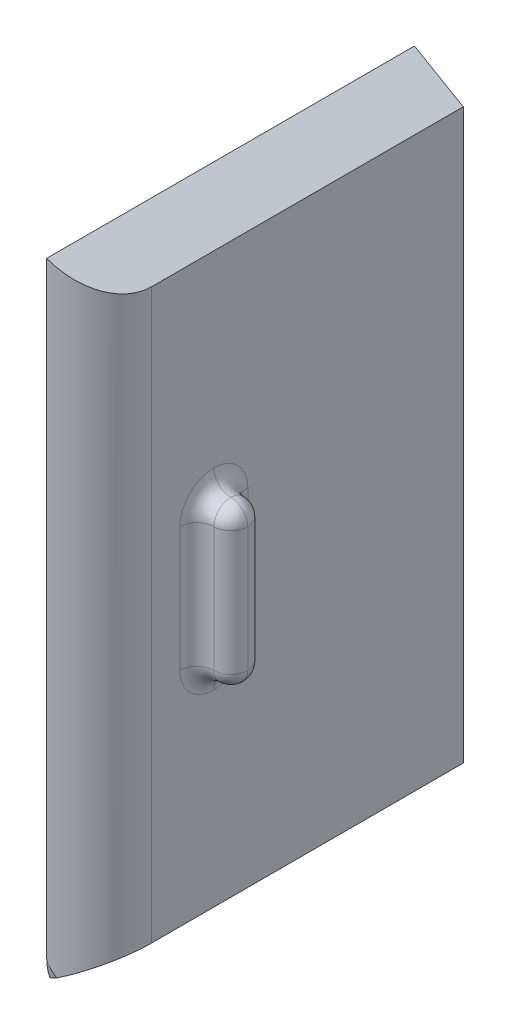
ISO-10303-21;
HEADER;
FILE_DESCRIPTION(('STEP AP214'),'2;1');
FILE_NAME('part.step','',(''),(''),'','','');
FILE_SCHEMA(('AUTOMOTIVE_DESIGN { 1 0 10303 214 1 1 1 1 }'));
ENDSEC;
DATA;
#1=APPLICATION_CONTEXT('core data for automotive mechanical design processes');
#2=APPLICATION_PROTOCOL_DEFINITION('international standard','automotive_design',2000,#1);
#3=PRODUCT_CONTEXT('',#1,'mechanical');
#4=PRODUCT('Part','Part','',(#3));
#5=PRODUCT_RELATED_PRODUCT_CATEGORY('part','',(#4));
#6=PRODUCT_DEFINITION_FORMATION('','',#4);
#7=PRODUCT_DEFINITION_CONTEXT('part definition',#1,'design');
#8=PRODUCT_DEFINITION('design','',#6,#7);
#9=PRODUCT_DEFINITION_SHAPE('','',#8);
#10=(LENGTH_UNIT() NAMED_UNIT(*) SI_UNIT(.MILLI.,.METRE.));
#11=(NAMED_UNIT(*) PLANE_ANGLE_UNIT() SI_UNIT($,.RADIAN.));
#12=(NAMED_UNIT(*) SI_UNIT($,.STERADIAN.) SOLID_ANGLE_UNIT());
#13=UNCERTAINTY_MEASURE_WITH_UNIT(LENGTH_MEASURE(1.E-05),#10,'distance_accuracy_value','');
#14=(GEOMETRIC_REPRESENTATION_CONTEXT(3) GLOBAL_UNCERTAINTY_ASSIGNED_CONTEXT((#13)) GLOBAL_UNIT_ASSIGNED_CONTEXT((#10,
#11,#12)) REPRESENTATION_CONTEXT('',''));
#15=CARTESIAN_POINT('',(0.,0.,0.));
#16=DIRECTION('',(0.,0.,1.));
#17=DIRECTION('',(1.,0.,0.));
#18=AXIS2_PLACEMENT_3D('',#15,#16,#17);
#19=CARTESIAN_POINT('',(7.51840000000001,-33.6681989634393,-87.8829762420417));
#20=DIRECTION('',(0.5,-0.866025403784439,0.));
#21=DIRECTION('',(0.866025403784439,0.5,0.));
#22=AXIS2_PLACEMENT_3D('',#19,#20,#21);
#23=PLANE('',#22);
#24=CARTESIAN_POINT('',(6.0776783428885,-34.5,-5.));
#25=DIRECTION('',(0.5,-0.866025403784439,0.));
#26=DIRECTION('',(-0.866025403784439,-0.5,0.));
#27=AXIS2_PLACEMENT_3D('',#24,#25,#26);
#28=ELLIPSE('',#27,10.,5.);
#29=CARTESIAN_POINT('',(3.19999999999998,-36.1614283659078,-0.284106046044196));
#30=VERTEX_POINT('',#29);
#31=CARTESIAN_POINT('',(3.92879511642385,-35.7406583092564,-0.156368412061765));
#32=VERTEX_POINT('',#31);
#33=EDGE_CURVE('E60',#30,#32,#28,.F.);
#34=ORIENTED_EDGE('',*,*,#33,.F.);
#35=DIRECTION('',(0.,0.,1.));
#36=VECTOR('',#35,1.);
#37=CARTESIAN_POINT('',(3.19999999999999,-36.1614283659078,-87.8829762420417));
#38=LINE('',#37,#36);
#39=CARTESIAN_POINT('',(3.19999999999999,-36.1614283659078,-32.5));
#40=VERTEX_POINT('',#39);
#41=EDGE_CURVE('E179',#40,#30,#38,.T.);
#42=ORIENTED_EDGE('',*,*,#41,.F.);
#43=DIRECTION('',(0.866025403784439,0.5,0.));
#44=VECTOR('',#43,1.);
#45=CARTESIAN_POINT('',(7.51840000000001,-33.6681989634393,-32.5));
#46=LINE('',#45,#44);
#47=CARTESIAN_POINT('',(7.51840000000001,-33.6681989634393,-32.5));
#48=VERTEX_POINT('',#47);
#49=EDGE_CURVE('E219',#40,#48,#46,.T.);
#50=ORIENTED_EDGE('',*,*,#49,.T.);
#51=DIRECTION('',(0.,0.,1.));
#52=VECTOR('',#51,1.);
#53=CARTESIAN_POINT('',(7.51840000000001,-33.6681989634393,-87.8829762420417));
#54=LINE('',#53,#52);
#55=CARTESIAN_POINT('',(7.51840000000001,-33.6681989634393,-4.95332428173242));
#56=VERTEX_POINT('',#55);
#57=EDGE_CURVE('E225',#48,#56,#54,.T.);
#58=ORIENTED_EDGE('',*,*,#57,.T.);
#59=CARTESIAN_POINT('',(2.51840000000001,-36.5549503093875,-4.95332428173242));
#60=DIRECTION('',(0.5,-0.866025403784439,0.));
#61=DIRECTION('',(0.866025403784439,0.5,0.));
#62=AXIS2_PLACEMENT_3D('',#59,#60,#61);
#63=ELLIPSE('',#62,5.77350269189626,5.);
#64=EDGE_CURVE('E204',#56,#32,#63,.T.);
#65=ORIENTED_EDGE('',*,*,#64,.T.);
#66=EDGE_LOOP('',(#34,#42,#50,#58,#65));
#67=FACE_BOUND('',#66,.T.);
#68=ADVANCED_FACE('F43',(#67),#23,.T.);
#69=CARTESIAN_POINT('',(3.19999999999999,-36.1614283659078,-87.8829762420417));
#70=DIRECTION('',(-1.,0.,0.));
#71=DIRECTION('',(0.,-1.,0.));
#72=AXIS2_PLACEMENT_3D('',#69,#70,#71);
#73=PLANE('',#72);
#74=CARTESIAN_POINT('',(3.19999999999998,-34.5,-5.));
#75=DIRECTION('',(1.,0.,0.));
#76=DIRECTION('',(0.,1.,0.));
#77=AXIS2_PLACEMENT_3D('',#74,#75,#76);
#78=CIRCLE('',#77,5.);
#79=CARTESIAN_POINT('',(3.19999999999998,-34.5,0.));
#80=VERTEX_POINT('',#79);
#81=EDGE_CURVE('E246',#80,#30,#78,.T.);
#82=ORIENTED_EDGE('',*,*,#81,.F.);
#83=DIRECTION('',(0.,-1.,0.));
#84=VECTOR('',#83,1.);
#85=CARTESIAN_POINT('',(3.19999999999999,-36.1614283659078,0.));
#86=LINE('',#85,#84);
#87=CARTESIAN_POINT('',(3.19999999999998,19.0529309880371,0.));
#88=VERTEX_POINT('',#87);
#89=EDGE_CURVE('E176',#88,#80,#86,.T.);
#90=ORIENTED_EDGE('',*,*,#89,.F.);
#91=DIRECTION('',(0.,0.,1.));
#92=VECTOR('',#91,1.);
#93=CARTESIAN_POINT('',(3.19999999999998,19.0529309880371,-87.8829762420417));
#94=LINE('',#93,#92);
#95=CARTESIAN_POINT('',(3.19999999999998,19.0529309880371,-32.5));
#96=VERTEX_POINT('',#95);
#97=EDGE_CURVE('E222',#96,#88,#94,.T.);
#98=ORIENTED_EDGE('',*,*,#97,.F.);
#99=DIRECTION('',(0.,-1.,0.));
#100=VECTOR('',#99,1.);
#101=CARTESIAN_POINT('',(3.19999999999999,-36.1614283659078,-32.5));
#102=LINE('',#101,#100);
#103=EDGE_CURVE('E214',#96,#40,#102,.T.);
#104=ORIENTED_EDGE('',*,*,#103,.T.);
#105=ORIENTED_EDGE('',*,*,#41,.T.);
#106=EDGE_LOOP('',(#82,#90,#98,#104,#105));
#107=FACE_BOUND('',#106,.T.);
#108=ADVANCED_FACE('F263',(#107),#73,.T.);
#109=CARTESIAN_POINT('',(7.51840000000001,16.5597015855686,-87.8829762420417));
#110=DIRECTION('',(1.,0.,0.));
#111=DIRECTION('',(0.,1.,0.));
#112=AXIS2_PLACEMENT_3D('',#109,#110,#111);
#113=PLANE('',#112);
#114=DIRECTION('',(0.,0.,1.));
#115=VECTOR('',#114,1.);
#116=CARTESIAN_POINT('',(7.51840000000001,16.5597015855686,-87.8829762420417));
#117=LINE('',#116,#115);
#118=CARTESIAN_POINT('',(7.5184,16.5597015855686,-32.5));
#119=VERTEX_POINT('',#118);
#120=CARTESIAN_POINT('',(7.51840000000001,16.5597015855686,-4.95332428173242));
#121=VERTEX_POINT('',#120);
#122=EDGE_CURVE('E228',#119,#121,#117,.T.);
#123=ORIENTED_EDGE('',*,*,#122,.T.);
#124=DIRECTION('',(0.,-1.,0.));
#125=VECTOR('',#124,1.);
#126=CARTESIAN_POINT('',(7.51840000000001,-33.6681989634393,-4.95332428173242));
#127=LINE('',#126,#125);
#128=EDGE_CURVE('E206',#121,#56,#127,.T.);
#129=ORIENTED_EDGE('',*,*,#128,.T.);
#130=ORIENTED_EDGE('',*,*,#57,.F.);
#131=DIRECTION('',(0.,1.,0.));
#132=VECTOR('',#131,1.);
#133=CARTESIAN_POINT('',(7.51840000000001,16.5597015855686,-32.5));
#134=LINE('',#133,#132);
#135=EDGE_CURVE('E215',#48,#119,#134,.T.);
#136=ORIENTED_EDGE('',*,*,#135,.T.);
#137=EDGE_LOOP('',(#123,#129,#130,#136));
#138=FACE_BOUND('',#137,.T.);
#139=CARTESIAN_POINT('',(7.51840000000001,-3.05424868893539,-10.4533242817324));
#140=DIRECTION('',(1.,0.,0.));
#141=DIRECTION('',(0.,1.,0.));
#142=AXIS2_PLACEMENT_3D('',#139,#140,#141);
#143=CIRCLE('',#142,3.);
#144=CARTESIAN_POINT('',(7.51840000000001,-0.0542486889353898,-10.4533242817324));
#145=VERTEX_POINT('',#144);
#146=CARTESIAN_POINT('',(7.51840000000001,-3.05424868893539,-7.45332428173242));
#147=VERTEX_POINT('',#146);
#148=EDGE_CURVE('E127',#145,#147,#143,.T.);
#149=ORIENTED_EDGE('',*,*,#148,.F.);
#150=CARTESIAN_POINT('',(7.51840000000001,-3.05424868893539,-10.4533242817324));
#151=DIRECTION('',(1.,0.,0.));
#152=DIRECTION('',(0.,1.,0.));
#153=AXIS2_PLACEMENT_3D('',#150,#151,#152);
#154=CIRCLE('',#153,3.);
#155=CARTESIAN_POINT('',(7.51840000000001,-3.05424868893539,-13.4533242817324));
#156=VERTEX_POINT('',#155);
#157=EDGE_CURVE('E192',#156,#145,#154,.T.);
#158=ORIENTED_EDGE('',*,*,#157,.F.);
#159=DIRECTION('',(0.,1.,0.));
#160=VECTOR('',#159,1.);
#161=CARTESIAN_POINT('',(7.51840000000001,16.5597015855685,-13.4533242817324));
#162=LINE('',#161,#160);
#163=CARTESIAN_POINT('',(7.51840000000001,-14.0542486889354,-13.4533242817324));
#164=VERTEX_POINT('',#163);
#165=EDGE_CURVE('E188',#156,#164,#162,.F.);
#166=ORIENTED_EDGE('',*,*,#165,.T.);
#167=CARTESIAN_POINT('',(7.51840000000001,-14.0542486889354,-10.4533242817324));
#168=DIRECTION('',(1.,0.,0.));
#169=DIRECTION('',(0.,1.,0.));
#170=AXIS2_PLACEMENT_3D('',#167,#168,#169);
#171=CIRCLE('',#170,3.);
#172=CARTESIAN_POINT('',(7.51840000000001,-17.0542486889354,-10.4533242817324));
#173=VERTEX_POINT('',#172);
#174=EDGE_CURVE('E185',#173,#164,#171,.T.);
#175=ORIENTED_EDGE('',*,*,#174,.F.);
#176=CARTESIAN_POINT('',(7.51840000000001,-14.0542486889354,-10.4533242817324));
#177=DIRECTION('',(1.,0.,0.));
#178=DIRECTION('',(0.,1.,0.));
#179=AXIS2_PLACEMENT_3D('',#176,#177,#178);
#180=CIRCLE('',#179,3.);
#181=CARTESIAN_POINT('',(7.51840000000001,-14.0542486889354,-7.45332428173242));
#182=VERTEX_POINT('',#181);
#183=EDGE_CURVE('E149',#182,#173,#180,.T.);
#184=ORIENTED_EDGE('',*,*,#183,.F.);
#185=DIRECTION('',(0.,-1.,0.));
#186=VECTOR('',#185,1.);
#187=CARTESIAN_POINT('',(7.51840000000001,16.5597015855685,-7.45332428173243));
#188=LINE('',#187,#186);
#189=EDGE_CURVE('E190',#182,#147,#188,.F.);
#190=ORIENTED_EDGE('',*,*,#189,.T.);
#191=EDGE_LOOP('',(#149,#158,#166,#175,#184,#190));
#192=FACE_BOUND('',#191,.T.);
#193=ADVANCED_FACE('F259',(#138,#192),#113,.T.);
#194=CARTESIAN_POINT('',(3.19999999999998,19.0529309880371,-87.8829762420417));
#195=DIRECTION('',(0.5,0.866025403784439,0.));
#196=DIRECTION('',(-0.866025403784439,0.5,0.));
#197=AXIS2_PLACEMENT_3D('',#194,#195,#196);
#198=PLANE('',#197);
#199=ORIENTED_EDGE('',*,*,#97,.T.);
#200=CARTESIAN_POINT('',(2.5184,19.4464529315167,-4.95332428173242));
#201=DIRECTION('',(0.5,0.866025403784439,0.));
#202=DIRECTION('',(-0.866025403784439,0.5,0.));
#203=AXIS2_PLACEMENT_3D('',#200,#201,#202);
#204=ELLIPSE('',#203,5.77350269189626,5.);
#205=EDGE_CURVE('E211',#88,#121,#204,.T.);
#206=ORIENTED_EDGE('',*,*,#205,.T.);
#207=ORIENTED_EDGE('',*,*,#122,.F.);
#208=DIRECTION('',(-0.866025403784439,0.5,0.));
#209=VECTOR('',#208,1.);
#210=CARTESIAN_POINT('',(3.19999999999998,19.052930988037,-32.5));
#211=LINE('',#210,#209);
#212=EDGE_CURVE('E218',#119,#96,#211,.T.);
#213=ORIENTED_EDGE('',*,*,#212,.T.);
#214=EDGE_LOOP('',(#199,#206,#207,#213));
#215=FACE_BOUND('',#214,.T.);
#216=ADVANCED_FACE('F255',(#215),#198,.T.);
#217=CARTESIAN_POINT('',(0.,0.,-32.5));
#218=DIRECTION('',(0.,0.,-1.));
#219=DIRECTION('',(0.,1.,0.));
#220=AXIS2_PLACEMENT_3D('',#217,#218,#219);
#221=PLANE('',#220);
#222=ORIENTED_EDGE('',*,*,#135,.F.);
#223=ORIENTED_EDGE('',*,*,#49,.F.);
#224=ORIENTED_EDGE('',*,*,#103,.F.);
#225=ORIENTED_EDGE('',*,*,#212,.F.);
#226=EDGE_LOOP('',(#222,#223,#224,#225));
#227=FACE_BOUND('',#226,.T.);
#228=ADVANCED_FACE('F251',(#227),#221,.T.);
#229=CARTESIAN_POINT('',(2.51840000000001,0.,-4.95332428173242));
#230=DIRECTION('',(0.,1.,0.));
#231=DIRECTION('',(-1.,0.,0.));
#232=AXIS2_PLACEMENT_3D('',#229,#230,#231);
#233=CYLINDRICAL_SURFACE('',#232,5.);
#234=CARTESIAN_POINT('',(3.19999999999998,-34.5,0.));
#235=CARTESIAN_POINT('',(3.19974022040583,-34.5521415158443,1.82125224956412E-05));
#236=CARTESIAN_POINT('',(3.20595871298937,-34.6036520293249,-0.000814210793002077));
#237=CARTESIAN_POINT('',(3.22788334683383,-34.7034276396125,-0.00390160884452909));
#238=CARTESIAN_POINT('',(3.24336883089618,-34.7517400555228,-0.00612355133984807));
#239=CARTESIAN_POINT('',(3.28259551977134,-34.8505197935517,-0.0120271832569065));
#240=CARTESIAN_POINT('',(3.30703213008149,-34.9006818810878,-0.0158375067557172));
#241=CARTESIAN_POINT('',(3.36047119049653,-34.9984516908501,-0.0246665844249504));
#242=CARTESIAN_POINT('',(3.38948297883622,-35.0460539157629,-0.0296878214907631));
#243=CARTESIAN_POINT('',(3.48222387122209,-35.1885923653909,-0.0466954439299404));
#244=CARTESIAN_POINT('',(3.55027385256511,-35.2804533434416,-0.0604392371585273));
#245=CARTESIAN_POINT('',(3.67654809528612,-35.4417453328279,-0.0889568113503177));
#246=CARTESIAN_POINT('',(3.73398975323904,-35.5119666315379,-0.102965206134418));
#247=CARTESIAN_POINT('',(3.85048238121999,-35.6505544792488,-0.133659227157761));
#248=CARTESIAN_POINT('',(3.90953428321242,-35.7189199064036,-0.150346432343317));
#249=CARTESIAN_POINT('',(4.02484918057222,-35.8501941935754,-0.185303065534363));
#250=CARTESIAN_POINT('',(4.0810672621642,-35.9131845484073,-0.203417768945925));
#251=CARTESIAN_POINT('',(4.19379234986491,-36.0380653284678,-0.241995677979165));
#252=CARTESIAN_POINT('',(4.25029902733219,-36.0999567502527,-0.262456615567674));
#253=CARTESIAN_POINT('',(4.3068074109432,-36.1614283659078,-0.284106046044198));
#254=B_SPLINE_CURVE_WITH_KNOTS('',3,(#234,#235,#236,#237,#238,#239,#240,#241,#242,#243,#244,
#245,#246,#247,#248,#249,#250,#251,#252,#253),.UNSPECIFIED.,.F.,.F.,(4,2,2,2,2,2,2,2,2,4),(0.,
0.155076239861064,0.306599186717242,0.474010318815843,0.641767679044356,0.986604246178533,
1.26196597208303,1.5374906018801,1.79650549170412,2.05527207756317),.UNSPECIFIED.);
#255=EDGE_CURVE('E238',#80,#32,#254,.T.);
#256=ORIENTED_EDGE('',*,*,#255,.T.);
#257=ORIENTED_EDGE('',*,*,#64,.F.);
#258=ORIENTED_EDGE('',*,*,#128,.F.);
#259=ORIENTED_EDGE('',*,*,#205,.F.);
#260=ORIENTED_EDGE('',*,*,#89,.T.);
#261=EDGE_LOOP('',(#256,#257,#258,#259,#260));
#262=FACE_BOUND('',#261,.T.);
#263=ADVANCED_FACE('F254',(#262),#233,.T.);
#264=CARTESIAN_POINT('',(9.01840000000001,0.,-10.4533242817324));
#265=DIRECTION('',(0.,-1.,0.));
#266=DIRECTION('',(1.,0.,0.));
#267=AXIS2_PLACEMENT_3D('',#264,#265,#266);
#268=CYLINDRICAL_SURFACE('',#267,1.5);
#269=DIRECTION('',(0.,1.,0.));
#270=VECTOR('',#269,1.);
#271=CARTESIAN_POINT('',(10.5184,-1.55424868893539,-10.4533242817324));
#272=LINE('',#271,#270);
#273=CARTESIAN_POINT('',(10.5184,-14.0542486889354,-10.4533242817324));
#274=VERTEX_POINT('',#273);
#275=CARTESIAN_POINT('',(10.5184,-3.05424868893539,-10.4533242817324));
#276=VERTEX_POINT('',#275);
#277=EDGE_CURVE('E123',#274,#276,#272,.T.);
#278=ORIENTED_EDGE('',*,*,#277,.F.);
#279=CARTESIAN_POINT('',(9.01840000000001,-14.0542486889354,-10.4533242817324));
#280=DIRECTION('',(0.,-1.,0.));
#281=DIRECTION('',(1.,0.,0.));
#282=AXIS2_PLACEMENT_3D('',#279,#280,#281);
#283=CIRCLE('',#282,1.5);
#284=CARTESIAN_POINT('',(9.01840000000001,-14.0542486889354,-11.9533242817324));
#285=VERTEX_POINT('',#284);
#286=EDGE_CURVE('E11',#274,#285,#283,.F.);
#287=ORIENTED_EDGE('',*,*,#286,.T.);
#288=DIRECTION('',(0.,1.,0.));
#289=VECTOR('',#288,1.);
#290=CARTESIAN_POINT('',(9.01840000000001,-15.5542486889354,-11.9533242817324));
#291=LINE('',#290,#289);
#292=CARTESIAN_POINT('',(9.01840000000001,-3.05424868893539,-11.9533242817324));
#293=VERTEX_POINT('',#292);
#294=EDGE_CURVE('E150',#293,#285,#291,.F.);
#295=ORIENTED_EDGE('',*,*,#294,.F.);
#296=CARTESIAN_POINT('',(9.01840000000001,-3.05424868893539,-10.4533242817324));
#297=DIRECTION('',(0.,-1.,0.));
#298=DIRECTION('',(1.,0.,0.));
#299=AXIS2_PLACEMENT_3D('',#296,#297,#298);
#300=CIRCLE('',#299,1.5);
#301=EDGE_CURVE('E52',#293,#276,#300,.T.);
#302=ORIENTED_EDGE('',*,*,#301,.T.);
#303=EDGE_LOOP('',(#278,#287,#295,#302));
#304=FACE_BOUND('',#303,.T.);
#305=ADVANCED_FACE('F197',(#304),#268,.T.);
#306=CARTESIAN_POINT('',(9.01840000000001,0.,-10.4533242817324));
#307=DIRECTION('',(0.,1.,0.));
#308=DIRECTION('',(0.,0.,1.));
#309=AXIS2_PLACEMENT_3D('',#306,#307,#308);
#310=CYLINDRICAL_SURFACE('',#309,1.5);
#311=DIRECTION('',(0.,-1.,0.));
#312=VECTOR('',#311,1.);
#313=CARTESIAN_POINT('',(9.01840000000001,-1.55424868893539,-8.95332428173242));
#314=LINE('',#313,#312);
#315=CARTESIAN_POINT('',(9.01840000000001,-14.0542486889354,-8.95332428173242));
#316=VERTEX_POINT('',#315);
#317=CARTESIAN_POINT('',(9.01840000000001,-3.05424868893539,-8.95332428173242));
#318=VERTEX_POINT('',#317);
#319=EDGE_CURVE('E122',#316,#318,#314,.F.);
#320=ORIENTED_EDGE('',*,*,#319,.F.);
#321=CARTESIAN_POINT('',(9.01840000000001,-14.0542486889354,-10.4533242817324));
#322=DIRECTION('',(0.,1.,0.));
#323=DIRECTION('',(0.,0.,1.));
#324=AXIS2_PLACEMENT_3D('',#321,#322,#323);
#325=CIRCLE('',#324,1.5);
#326=EDGE_CURVE('E126',#316,#274,#325,.T.);
#327=ORIENTED_EDGE('',*,*,#326,.T.);
#328=ORIENTED_EDGE('',*,*,#277,.T.);
#329=CARTESIAN_POINT('',(9.01840000000001,-3.05424868893539,-10.4533242817324));
#330=DIRECTION('',(0.,1.,0.));
#331=DIRECTION('',(0.,0.,1.));
#332=AXIS2_PLACEMENT_3D('',#329,#330,#331);
#333=CIRCLE('',#332,1.5);
#334=EDGE_CURVE('E118',#276,#318,#333,.F.);
#335=ORIENTED_EDGE('',*,*,#334,.T.);
#336=EDGE_LOOP('',(#320,#327,#328,#335));
#337=FACE_BOUND('',#336,.T.);
#338=ADVANCED_FACE('F120',(#337),#310,.T.);
#339=CARTESIAN_POINT('',(9.01840000000001,-14.0542486889354,-10.4533242817324));
#340=DIRECTION('',(0.,0.,1.));
#341=DIRECTION('',(1.,0.,0.));
#342=AXIS2_PLACEMENT_3D('',#339,#340,#341);
#343=SPHERICAL_SURFACE('',#342,1.5);
#344=CARTESIAN_POINT('',(9.01840000000001,-14.0542486889354,-10.4533242817324));
#345=DIRECTION('',(-1.,0.,0.));
#346=DIRECTION('',(0.,0.,1.));
#347=AXIS2_PLACEMENT_3D('',#344,#345,#346);
#348=CIRCLE('',#347,1.5);
#349=CARTESIAN_POINT('',(9.01840000000001,-15.5542486889354,-10.4533242817324));
#350=VERTEX_POINT('',#349);
#351=EDGE_CURVE('E170',#285,#350,#348,.T.);
#352=ORIENTED_EDGE('',*,*,#351,.F.);
#353=ORIENTED_EDGE('',*,*,#286,.F.);
#354=CARTESIAN_POINT('',(9.01840000000001,-14.0542486889354,-10.4533242817324));
#355=DIRECTION('',(0.,0.,1.));
#356=DIRECTION('',(1.,0.,0.));
#357=AXIS2_PLACEMENT_3D('',#354,#355,#356);
#358=CIRCLE('',#357,1.5);
#359=EDGE_CURVE('E47',#350,#274,#358,.T.);
#360=ORIENTED_EDGE('',*,*,#359,.F.);
#361=EDGE_LOOP('',(#352,#353,#360));
#362=FACE_BOUND('',#361,.T.);
#363=ADVANCED_FACE('F45',(#362),#343,.T.);
#364=CARTESIAN_POINT('',(9.01840000000001,-14.0542486889354,-10.4533242817324));
#365=DIRECTION('',(0.,0.,1.));
#366=DIRECTION('',(1.,0.,0.));
#367=AXIS2_PLACEMENT_3D('',#364,#365,#366);
#368=SPHERICAL_SURFACE('',#367,1.5);
#369=ORIENTED_EDGE('',*,*,#359,.T.);
#370=ORIENTED_EDGE('',*,*,#326,.F.);
#371=CARTESIAN_POINT('',(9.01840000000001,-14.0542486889354,-10.4533242817324));
#372=DIRECTION('',(-1.,0.,0.));
#373=DIRECTION('',(0.,0.,1.));
#374=AXIS2_PLACEMENT_3D('',#371,#372,#373);
#375=CIRCLE('',#374,1.5);
#376=EDGE_CURVE('E169',#350,#316,#375,.T.);
#377=ORIENTED_EDGE('',*,*,#376,.F.);
#378=EDGE_LOOP('',(#369,#370,#377));
#379=FACE_BOUND('',#378,.T.);
#380=ADVANCED_FACE('F299',(#379),#368,.T.);
#381=CARTESIAN_POINT('',(9.01840000000001,-14.0542486889354,-10.4533242817324));
#382=DIRECTION('',(1.,0.,0.));
#383=DIRECTION('',(0.,1.,0.));
#384=AXIS2_PLACEMENT_3D('',#381,#382,#383);
#385=TOROIDAL_SURFACE('',#384,3.,1.5);
#386=CARTESIAN_POINT('',(9.01840000000001,-17.0542486889354,-10.4533242817324));
#387=DIRECTION('',(0.,0.,1.));
#388=DIRECTION('',(1.,0.,0.));
#389=AXIS2_PLACEMENT_3D('',#386,#387,#388);
#390=CIRCLE('',#389,1.5);
#391=EDGE_CURVE('E166',#350,#173,#390,.T.);
#392=ORIENTED_EDGE('',*,*,#391,.T.);
#393=ORIENTED_EDGE('',*,*,#174,.T.);
#394=CARTESIAN_POINT('',(9.01840000000001,-14.0542486889354,-13.4533242817324));
#395=DIRECTION('',(0.,1.,0.));
#396=DIRECTION('',(0.,0.,1.));
#397=AXIS2_PLACEMENT_3D('',#394,#395,#396);
#398=CIRCLE('',#397,1.5);
#399=EDGE_CURVE('E162',#285,#164,#398,.F.);
#400=ORIENTED_EDGE('',*,*,#399,.F.);
#401=ORIENTED_EDGE('',*,*,#351,.T.);
#402=EDGE_LOOP('',(#392,#393,#400,#401));
#403=FACE_BOUND('',#402,.T.);
#404=ADVANCED_FACE('F199',(#403),#385,.F.);
#405=CARTESIAN_POINT('',(9.01840000000001,-3.05424868893539,-10.4533242817324));
#406=DIRECTION('',(0.,0.,1.));
#407=DIRECTION('',(1.,0.,0.));
#408=AXIS2_PLACEMENT_3D('',#405,#406,#407);
#409=SPHERICAL_SURFACE('',#408,1.5);
#410=CARTESIAN_POINT('',(9.01840000000001,-3.05424868893539,-10.4533242817324));
#411=DIRECTION('',(0.,0.,-1.));
#412=DIRECTION('',(0.,1.,0.));
#413=AXIS2_PLACEMENT_3D('',#410,#411,#412);
#414=CIRCLE('',#413,1.5);
#415=CARTESIAN_POINT('',(9.01840000000001,-1.55424868893539,-10.4533242817324));
#416=VERTEX_POINT('',#415);
#417=EDGE_CURVE('E132',#276,#416,#414,.F.);
#418=ORIENTED_EDGE('',*,*,#417,.F.);
#419=ORIENTED_EDGE('',*,*,#301,.F.);
#420=CARTESIAN_POINT('',(9.01840000000001,-3.05424868893539,-10.4533242817324));
#421=DIRECTION('',(-1.,0.,0.));
#422=DIRECTION('',(0.,0.,1.));
#423=AXIS2_PLACEMENT_3D('',#420,#421,#422);
#424=CIRCLE('',#423,1.5);
#425=EDGE_CURVE('E138',#416,#293,#424,.T.);
#426=ORIENTED_EDGE('',*,*,#425,.F.);
#427=EDGE_LOOP('',(#418,#419,#426));
#428=FACE_BOUND('',#427,.T.);
#429=ADVANCED_FACE('F294',(#428),#409,.T.);
#430=CARTESIAN_POINT('',(9.01840000000001,-3.05424868893539,-10.4533242817324));
#431=DIRECTION('',(0.,0.,1.));
#432=DIRECTION('',(1.,0.,0.));
#433=AXIS2_PLACEMENT_3D('',#430,#431,#432);
#434=SPHERICAL_SURFACE('',#433,1.5);
#435=ORIENTED_EDGE('',*,*,#334,.F.);
#436=ORIENTED_EDGE('',*,*,#417,.T.);
#437=CARTESIAN_POINT('',(9.01840000000001,-3.05424868893539,-10.4533242817324));
#438=DIRECTION('',(-1.,0.,0.));
#439=DIRECTION('',(0.,0.,1.));
#440=AXIS2_PLACEMENT_3D('',#437,#438,#439);
#441=CIRCLE('',#440,1.5);
#442=EDGE_CURVE('E130',#318,#416,#441,.T.);
#443=ORIENTED_EDGE('',*,*,#442,.F.);
#444=EDGE_LOOP('',(#435,#436,#443));
#445=FACE_BOUND('',#444,.T.);
#446=ADVANCED_FACE('F131',(#445),#434,.T.);
#447=CARTESIAN_POINT('',(9.01840000000001,-14.0542486889354,-10.4533242817324));
#448=DIRECTION('',(1.,0.,0.));
#449=DIRECTION('',(0.,1.,0.));
#450=AXIS2_PLACEMENT_3D('',#447,#448,#449);
#451=TOROIDAL_SURFACE('',#450,3.,1.5);
#452=ORIENTED_EDGE('',*,*,#391,.F.);
#453=ORIENTED_EDGE('',*,*,#376,.T.);
#454=CARTESIAN_POINT('',(9.01840000000001,-14.0542486889354,-7.45332428173242));
#455=DIRECTION('',(0.,1.,0.));
#456=DIRECTION('',(0.,0.,1.));
#457=AXIS2_PLACEMENT_3D('',#454,#455,#456);
#458=CIRCLE('',#457,1.5);
#459=EDGE_CURVE('E139',#182,#316,#458,.F.);
#460=ORIENTED_EDGE('',*,*,#459,.F.);
#461=ORIENTED_EDGE('',*,*,#183,.T.);
#462=EDGE_LOOP('',(#452,#453,#460,#461));
#463=FACE_BOUND('',#462,.T.);
#464=ADVANCED_FACE('F288',(#463),#451,.F.);
#465=CARTESIAN_POINT('',(9.01840000000001,-1.55424868893539,-13.4533242817324));
#466=DIRECTION('',(0.,1.,0.));
#467=DIRECTION('',(0.,0.,1.));
#468=AXIS2_PLACEMENT_3D('',#465,#466,#467);
#469=CYLINDRICAL_SURFACE('',#468,1.5);
#470=ORIENTED_EDGE('',*,*,#399,.T.);
#471=ORIENTED_EDGE('',*,*,#165,.F.);
#472=CARTESIAN_POINT('',(9.01840000000001,-3.05424868893539,-13.4533242817324));
#473=DIRECTION('',(0.,-1.,0.));
#474=DIRECTION('',(0.,0.,-1.));
#475=AXIS2_PLACEMENT_3D('',#472,#473,#474);
#476=CIRCLE('',#475,1.5);
#477=EDGE_CURVE('E153',#293,#156,#476,.T.);
#478=ORIENTED_EDGE('',*,*,#477,.F.);
#479=ORIENTED_EDGE('',*,*,#294,.T.);
#480=EDGE_LOOP('',(#470,#471,#478,#479));
#481=FACE_BOUND('',#480,.T.);
#482=ADVANCED_FACE('F203',(#481),#469,.F.);
#483=CARTESIAN_POINT('',(9.01840000000001,-1.55424868893539,-7.45332428173242));
#484=DIRECTION('',(0.,-1.,0.));
#485=DIRECTION('',(0.,0.,-1.));
#486=AXIS2_PLACEMENT_3D('',#483,#484,#485);
#487=CYLINDRICAL_SURFACE('',#486,1.5);
#488=ORIENTED_EDGE('',*,*,#459,.T.);
#489=ORIENTED_EDGE('',*,*,#319,.T.);
#490=CARTESIAN_POINT('',(9.01840000000001,-3.05424868893539,-7.45332428173242));
#491=DIRECTION('',(0.,-1.,0.));
#492=DIRECTION('',(0.,0.,-1.));
#493=AXIS2_PLACEMENT_3D('',#490,#491,#492);
#494=CIRCLE('',#493,1.5);
#495=EDGE_CURVE('E145',#147,#318,#494,.T.);
#496=ORIENTED_EDGE('',*,*,#495,.F.);
#497=ORIENTED_EDGE('',*,*,#189,.F.);
#498=EDGE_LOOP('',(#488,#489,#496,#497));
#499=FACE_BOUND('',#498,.T.);
#500=ADVANCED_FACE('F143',(#499),#487,.F.);
#501=CARTESIAN_POINT('',(9.01840000000001,-3.05424868893539,-10.4533242817324));
#502=DIRECTION('',(1.,0.,0.));
#503=DIRECTION('',(0.,1.,0.));
#504=AXIS2_PLACEMENT_3D('',#501,#502,#503);
#505=TOROIDAL_SURFACE('',#504,3.,1.5);
#506=ORIENTED_EDGE('',*,*,#477,.T.);
#507=ORIENTED_EDGE('',*,*,#157,.T.);
#508=CARTESIAN_POINT('',(9.01840000000001,-0.0542486889353896,-10.4533242817324));
#509=DIRECTION('',(0.,0.,1.));
#510=DIRECTION('',(0.,-1.,0.));
#511=AXIS2_PLACEMENT_3D('',#508,#509,#510);
#512=CIRCLE('',#511,1.5);
#513=EDGE_CURVE('E154',#416,#145,#512,.F.);
#514=ORIENTED_EDGE('',*,*,#513,.F.);
#515=ORIENTED_EDGE('',*,*,#425,.T.);
#516=EDGE_LOOP('',(#506,#507,#514,#515));
#517=FACE_BOUND('',#516,.T.);
#518=ADVANCED_FACE('F280',(#517),#505,.F.);
#519=CARTESIAN_POINT('',(9.01840000000001,-3.05424868893539,-10.4533242817324));
#520=DIRECTION('',(1.,0.,0.));
#521=DIRECTION('',(0.,1.,0.));
#522=AXIS2_PLACEMENT_3D('',#519,#520,#521);
#523=TOROIDAL_SURFACE('',#522,3.,1.5);
#524=ORIENTED_EDGE('',*,*,#495,.T.);
#525=ORIENTED_EDGE('',*,*,#442,.T.);
#526=ORIENTED_EDGE('',*,*,#513,.T.);
#527=ORIENTED_EDGE('',*,*,#148,.T.);
#528=EDGE_LOOP('',(#524,#525,#526,#527));
#529=FACE_BOUND('',#528,.T.);
#530=ADVANCED_FACE('F152',(#529),#523,.F.);
#531=CARTESIAN_POINT('',(10.5194,-34.5,-5.));
#532=DIRECTION('',(-1.,0.,0.));
#533=DIRECTION('',(0.,-1.,0.));
#534=AXIS2_PLACEMENT_3D('',#531,#532,#533);
#535=CYLINDRICAL_SURFACE('',#534,5.);
#536=ORIENTED_EDGE('',*,*,#33,.T.);
#537=ORIENTED_EDGE('',*,*,#255,.F.);
#538=ORIENTED_EDGE('',*,*,#81,.T.);
#539=EDGE_LOOP('',(#536,#537,#538));
#540=FACE_BOUND('',#539,.T.);
#541=ADVANCED_FACE('F247',(#540),#535,.T.);
#542=CLOSED_SHELL('',(#68,#108,#193,#216,#228,#263,#305,#338,#363,#380,#404,#429,#446,#464,#482,
#500,#518,#530,#541));
#543=MANIFOLD_SOLID_BREP('B2',#542);
#544=ADVANCED_BREP_SHAPE_REPRESENTATION('',(#18,#543),#14);
#545=SHAPE_DEFINITION_REPRESENTATION(#9,#544);
ENDSEC;
END-ISO-10303-21;
